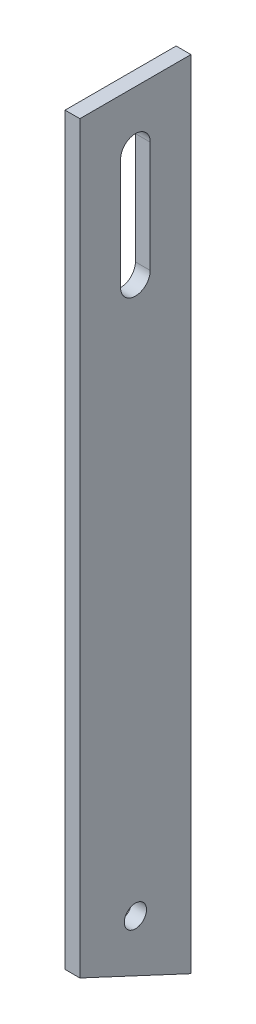
ISO-10303-21;
HEADER;
FILE_DESCRIPTION(('STEP AP214'),'2;1');
FILE_NAME('part.step','',(''),(''),'','','');
FILE_SCHEMA(('AUTOMOTIVE_DESIGN { 1 0 10303 214 1 1 1 1 }'));
ENDSEC;
DATA;
#1=APPLICATION_CONTEXT('core data for automotive mechanical design processes');
#2=APPLICATION_PROTOCOL_DEFINITION('international standard','automotive_design',2000,#1);
#3=PRODUCT_CONTEXT('',#1,'mechanical');
#4=PRODUCT('Part','Part','',(#3));
#5=PRODUCT_RELATED_PRODUCT_CATEGORY('part','',(#4));
#6=PRODUCT_DEFINITION_FORMATION('','',#4);
#7=PRODUCT_DEFINITION_CONTEXT('part definition',#1,'design');
#8=PRODUCT_DEFINITION('design','',#6,#7);
#9=PRODUCT_DEFINITION_SHAPE('','',#8);
#10=(LENGTH_UNIT() NAMED_UNIT(*) SI_UNIT(.MILLI.,.METRE.));
#11=(NAMED_UNIT(*) PLANE_ANGLE_UNIT() SI_UNIT($,.RADIAN.));
#12=(NAMED_UNIT(*) SI_UNIT($,.STERADIAN.) SOLID_ANGLE_UNIT());
#13=UNCERTAINTY_MEASURE_WITH_UNIT(LENGTH_MEASURE(1.E-05),#10,'distance_accuracy_value','');
#14=(GEOMETRIC_REPRESENTATION_CONTEXT(3) GLOBAL_UNCERTAINTY_ASSIGNED_CONTEXT((#13)) GLOBAL_UNIT_ASSIGNED_CONTEXT((#10,
#11,#12)) REPRESENTATION_CONTEXT('',''));
#15=CARTESIAN_POINT('',(0.,0.,0.));
#16=DIRECTION('',(0.,0.,1.));
#17=DIRECTION('',(1.,0.,0.));
#18=AXIS2_PLACEMENT_3D('',#15,#16,#17);
#19=CARTESIAN_POINT('',(4.,0.,0.));
#20=DIRECTION('',(1.,0.,0.));
#21=DIRECTION('',(0.,0.,-1.));
#22=AXIS2_PLACEMENT_3D('',#19,#20,#21);
#23=PLANE('',#22);
#24=CARTESIAN_POINT('',(4.0000000000001,21.,0.));
#25=DIRECTION('',(1.,0.,0.));
#26=DIRECTION('',(0.,0.,-1.));
#27=AXIS2_PLACEMENT_3D('',#24,#25,#26);
#28=CIRCLE('',#27,3.);
#29=CARTESIAN_POINT('',(4.00000000000008,21.,-3.));
#30=VERTEX_POINT('',#29);
#31=EDGE_CURVE('E336',#30,#30,#28,.T.);
#32=ORIENTED_EDGE('',*,*,#31,.F.);
#33=EDGE_LOOP('',(#32));
#34=FACE_BOUND('',#33,.T.);
#35=DIRECTION('',(0.,0.422618261740688,0.906307787036655));
#36=VECTOR('',#35,1.);
#37=CARTESIAN_POINT('',(3.99999999999989,0.,-15.));
#38=LINE('',#37,#36);
#39=CARTESIAN_POINT('',(3.99999999999989,0.,-15.));
#40=VERTEX_POINT('',#39);
#41=CARTESIAN_POINT('',(4.00000000000016,13.9892297446495,15.));
#42=VERTEX_POINT('',#41);
#43=EDGE_CURVE('E109',#40,#42,#38,.T.);
#44=ORIENTED_EDGE('',*,*,#43,.F.);
#45=DIRECTION('',(0.,1.,0.));
#46=VECTOR('',#45,1.);
#47=CARTESIAN_POINT('',(4.,215.,-15.));
#48=LINE('',#47,#46);
#49=CARTESIAN_POINT('',(4.,215.,-15.));
#50=VERTEX_POINT('',#49);
#51=EDGE_CURVE('E119',#40,#50,#48,.T.);
#52=ORIENTED_EDGE('',*,*,#51,.T.);
#53=DIRECTION('',(0.,0.,1.));
#54=VECTOR('',#53,1.);
#55=CARTESIAN_POINT('',(4.00000000000003,215.,15.));
#56=LINE('',#55,#54);
#57=CARTESIAN_POINT('',(4.00000000000003,215.,15.));
#58=VERTEX_POINT('',#57);
#59=EDGE_CURVE('E130',#50,#58,#56,.T.);
#60=ORIENTED_EDGE('',*,*,#59,.T.);
#61=DIRECTION('',(0.,-1.,0.));
#62=VECTOR('',#61,1.);
#63=CARTESIAN_POINT('',(4.00000000000003,215.,15.));
#64=LINE('',#63,#62);
#65=EDGE_CURVE('E122',#58,#42,#64,.T.);
#66=ORIENTED_EDGE('',*,*,#65,.T.);
#67=EDGE_LOOP('',(#44,#52,#60,#66));
#68=FACE_BOUND('',#67,.T.);
#69=DIRECTION('',(0.,-1.,0.));
#70=VECTOR('',#69,1.);
#71=CARTESIAN_POINT('',(4.00000000000003,200.,4.00000000000002));
#72=LINE('',#71,#70);
#73=CARTESIAN_POINT('',(4.00000000000003,200.,4.00000000000002));
#74=VERTEX_POINT('',#73);
#75=CARTESIAN_POINT('',(4.00000000000005,170.,4.00000000000002));
#76=VERTEX_POINT('',#75);
#77=EDGE_CURVE('E175',#74,#76,#72,.T.);
#78=ORIENTED_EDGE('',*,*,#77,.F.);
#79=CARTESIAN_POINT('',(4.00000000000003,200.,0.));
#80=DIRECTION('',(1.,0.,0.));
#81=DIRECTION('',(0.,0.,-1.));
#82=AXIS2_PLACEMENT_3D('',#79,#80,#81);
#83=CIRCLE('',#82,4.);
#84=CARTESIAN_POINT('',(4.,200.,-4.));
#85=VERTEX_POINT('',#84);
#86=EDGE_CURVE('E172',#85,#74,#83,.T.);
#87=ORIENTED_EDGE('',*,*,#86,.F.);
#88=DIRECTION('',(0.,1.,0.));
#89=VECTOR('',#88,1.);
#90=CARTESIAN_POINT('',(4.,200.,-4.));
#91=LINE('',#90,#89);
#92=CARTESIAN_POINT('',(4.00000000000005,170.,-4.));
#93=VERTEX_POINT('',#92);
#94=EDGE_CURVE('E182',#93,#85,#91,.T.);
#95=ORIENTED_EDGE('',*,*,#94,.F.);
#96=CARTESIAN_POINT('',(4.00000000000005,170.,0.));
#97=DIRECTION('',(1.,0.,0.));
#98=DIRECTION('',(0.,0.,-1.));
#99=AXIS2_PLACEMENT_3D('',#96,#97,#98);
#100=CIRCLE('',#99,4.);
#101=EDGE_CURVE('E179',#76,#93,#100,.T.);
#102=ORIENTED_EDGE('',*,*,#101,.F.);
#103=EDGE_LOOP('',(#78,#87,#95,#102));
#104=FACE_BOUND('',#103,.T.);
#105=ADVANCED_FACE('F40',(#34,#68,#104),#23,.T.);
#106=CARTESIAN_POINT('',(0.,0.,0.));
#107=DIRECTION('',(1.,0.,0.));
#108=DIRECTION('',(0.,0.,-1.));
#109=AXIS2_PLACEMENT_3D('',#106,#107,#108);
#110=PLANE('',#109);
#111=CARTESIAN_POINT('',(0.,21.,0.));
#112=DIRECTION('',(1.,0.,0.));
#113=DIRECTION('',(0.,0.,-1.));
#114=AXIS2_PLACEMENT_3D('',#111,#112,#113);
#115=CIRCLE('',#114,3.);
#116=CARTESIAN_POINT('',(0.,21.,-2.99999999999996));
#117=VERTEX_POINT('',#116);
#118=EDGE_CURVE('E44',#117,#117,#115,.T.);
#119=ORIENTED_EDGE('',*,*,#118,.T.);
#120=EDGE_LOOP('',(#119));
#121=FACE_BOUND('',#120,.T.);
#122=DIRECTION('',(0.,1.,0.));
#123=VECTOR('',#122,1.);
#124=CARTESIAN_POINT('',(0.,215.,-15.));
#125=LINE('',#124,#123);
#126=CARTESIAN_POINT('',(0.,0.,-15.));
#127=VERTEX_POINT('',#126);
#128=CARTESIAN_POINT('',(0.,215.,-15.));
#129=VERTEX_POINT('',#128);
#130=EDGE_CURVE('E145',#127,#129,#125,.T.);
#131=ORIENTED_EDGE('',*,*,#130,.F.);
#132=DIRECTION('',(0.,0.422618261740688,0.906307787036655));
#133=VECTOR('',#132,1.);
#134=CARTESIAN_POINT('',(0.,5.74533332339222,-2.6790929273508));
#135=LINE('',#134,#133);
#136=CARTESIAN_POINT('',(0.,13.9892297446495,15.));
#137=VERTEX_POINT('',#136);
#138=EDGE_CURVE('E112',#127,#137,#135,.T.);
#139=ORIENTED_EDGE('',*,*,#138,.T.);
#140=DIRECTION('',(0.,-1.,0.));
#141=VECTOR('',#140,1.);
#142=CARTESIAN_POINT('',(0.,215.,15.));
#143=LINE('',#142,#141);
#144=CARTESIAN_POINT('',(0.,215.,15.));
#145=VERTEX_POINT('',#144);
#146=EDGE_CURVE('E141',#145,#137,#143,.T.);
#147=ORIENTED_EDGE('',*,*,#146,.F.);
#148=DIRECTION('',(0.,0.,1.));
#149=VECTOR('',#148,1.);
#150=CARTESIAN_POINT('',(0.,215.,15.));
#151=LINE('',#150,#149);
#152=EDGE_CURVE('E137',#129,#145,#151,.T.);
#153=ORIENTED_EDGE('',*,*,#152,.F.);
#154=EDGE_LOOP('',(#131,#139,#147,#153));
#155=FACE_BOUND('',#154,.T.);
#156=CARTESIAN_POINT('',(0.,200.,0.));
#157=DIRECTION('',(1.,0.,0.));
#158=DIRECTION('',(0.,0.,-1.));
#159=AXIS2_PLACEMENT_3D('',#156,#157,#158);
#160=CIRCLE('',#159,4.);
#161=CARTESIAN_POINT('',(0.,200.,-4.));
#162=VERTEX_POINT('',#161);
#163=CARTESIAN_POINT('',(0.,200.,4.00000000000002));
#164=VERTEX_POINT('',#163);
#165=EDGE_CURVE('E65',#162,#164,#160,.T.);
#166=ORIENTED_EDGE('',*,*,#165,.T.);
#167=DIRECTION('',(0.,-1.,0.));
#168=VECTOR('',#167,1.);
#169=CARTESIAN_POINT('',(0.,200.,4.00000000000002));
#170=LINE('',#169,#168);
#171=CARTESIAN_POINT('',(0.,170.,4.00000000000002));
#172=VERTEX_POINT('',#171);
#173=EDGE_CURVE('E188',#164,#172,#170,.T.);
#174=ORIENTED_EDGE('',*,*,#173,.T.);
#175=CARTESIAN_POINT('',(0.,170.,0.));
#176=DIRECTION('',(1.,0.,0.));
#177=DIRECTION('',(0.,0.,-1.));
#178=AXIS2_PLACEMENT_3D('',#175,#176,#177);
#179=CIRCLE('',#178,4.);
#180=CARTESIAN_POINT('',(0.,170.,-4.));
#181=VERTEX_POINT('',#180);
#182=EDGE_CURVE('E192',#172,#181,#179,.T.);
#183=ORIENTED_EDGE('',*,*,#182,.T.);
#184=DIRECTION('',(0.,1.,0.));
#185=VECTOR('',#184,1.);
#186=CARTESIAN_POINT('',(0.,200.,-4.));
#187=LINE('',#186,#185);
#188=EDGE_CURVE('E176',#181,#162,#187,.T.);
#189=ORIENTED_EDGE('',*,*,#188,.T.);
#190=EDGE_LOOP('',(#166,#174,#183,#189));
#191=FACE_BOUND('',#190,.T.);
#192=ADVANCED_FACE('F163',(#121,#155,#191),#110,.F.);
#193=CARTESIAN_POINT('',(4.00000000000003,215.,15.));
#194=DIRECTION('',(0.,0.,-1.));
#195=DIRECTION('',(0.,1.,0.));
#196=AXIS2_PLACEMENT_3D('',#193,#194,#195);
#197=PLANE('',#196);
#198=ORIENTED_EDGE('',*,*,#146,.T.);
#199=DIRECTION('',(1.,0.,0.));
#200=VECTOR('',#199,1.);
#201=CARTESIAN_POINT('',(-0.99999999999989,13.9892297446495,15.));
#202=LINE('',#201,#200);
#203=EDGE_CURVE('E124',#137,#42,#202,.T.);
#204=ORIENTED_EDGE('',*,*,#203,.T.);
#205=ORIENTED_EDGE('',*,*,#65,.F.);
#206=DIRECTION('',(-1.,0.,0.));
#207=VECTOR('',#206,1.);
#208=CARTESIAN_POINT('',(4.00000000000003,215.,15.));
#209=LINE('',#208,#207);
#210=EDGE_CURVE('E134',#58,#145,#209,.T.);
#211=ORIENTED_EDGE('',*,*,#210,.T.);
#212=EDGE_LOOP('',(#198,#204,#205,#211));
#213=FACE_BOUND('',#212,.T.);
#214=ADVANCED_FACE('F42',(#213),#197,.F.);
#215=CARTESIAN_POINT('',(4.,215.,-15.));
#216=DIRECTION('',(0.,0.,1.));
#217=DIRECTION('',(0.,-1.,0.));
#218=AXIS2_PLACEMENT_3D('',#215,#216,#217);
#219=PLANE('',#218);
#220=ORIENTED_EDGE('',*,*,#130,.T.);
#221=DIRECTION('',(-1.,0.,0.));
#222=VECTOR('',#221,1.);
#223=CARTESIAN_POINT('',(4.,215.,-15.));
#224=LINE('',#223,#222);
#225=EDGE_CURVE('E50',#50,#129,#224,.T.);
#226=ORIENTED_EDGE('',*,*,#225,.F.);
#227=ORIENTED_EDGE('',*,*,#51,.F.);
#228=DIRECTION('',(-1.,0.,0.));
#229=VECTOR('',#228,1.);
#230=CARTESIAN_POINT('',(3.99999999999998,0.,-15.));
#231=LINE('',#230,#229);
#232=EDGE_CURVE('E11',#40,#127,#231,.T.);
#233=ORIENTED_EDGE('',*,*,#232,.T.);
#234=EDGE_LOOP('',(#220,#226,#227,#233));
#235=FACE_BOUND('',#234,.T.);
#236=ADVANCED_FACE('F126',(#235),#219,.F.);
#237=CARTESIAN_POINT('',(4.00000000000003,215.,15.));
#238=DIRECTION('',(0.,-1.,0.));
#239=DIRECTION('',(0.,0.,-1.));
#240=AXIS2_PLACEMENT_3D('',#237,#238,#239);
#241=PLANE('',#240);
#242=ORIENTED_EDGE('',*,*,#152,.T.);
#243=ORIENTED_EDGE('',*,*,#210,.F.);
#244=ORIENTED_EDGE('',*,*,#59,.F.);
#245=ORIENTED_EDGE('',*,*,#225,.T.);
#246=EDGE_LOOP('',(#242,#243,#244,#245));
#247=FACE_BOUND('',#246,.T.);
#248=ADVANCED_FACE('F159',(#247),#241,.F.);
#249=CARTESIAN_POINT('',(4.00000000000003,200.,0.));
#250=DIRECTION('',(-1.,0.,0.));
#251=DIRECTION('',(0.,0.,1.));
#252=AXIS2_PLACEMENT_3D('',#249,#250,#251);
#253=CYLINDRICAL_SURFACE('',#252,4.);
#254=ORIENTED_EDGE('',*,*,#165,.F.);
#255=DIRECTION('',(-1.,0.,0.));
#256=VECTOR('',#255,1.);
#257=CARTESIAN_POINT('',(4.,200.,-4.));
#258=LINE('',#257,#256);
#259=EDGE_CURVE('E185',#85,#162,#258,.T.);
#260=ORIENTED_EDGE('',*,*,#259,.F.);
#261=ORIENTED_EDGE('',*,*,#86,.T.);
#262=DIRECTION('',(-1.,0.,0.));
#263=VECTOR('',#262,1.);
#264=CARTESIAN_POINT('',(4.00000000000003,200.,4.00000000000002));
#265=LINE('',#264,#263);
#266=EDGE_CURVE('E146',#74,#164,#265,.T.);
#267=ORIENTED_EDGE('',*,*,#266,.T.);
#268=EDGE_LOOP('',(#254,#260,#261,#267));
#269=FACE_BOUND('',#268,.T.);
#270=ADVANCED_FACE('F209',(#269),#253,.F.);
#271=CARTESIAN_POINT('',(4.00000000000003,200.,4.00000000000002));
#272=DIRECTION('',(0.,0.,-1.));
#273=DIRECTION('',(0.,1.,0.));
#274=AXIS2_PLACEMENT_3D('',#271,#272,#273);
#275=PLANE('',#274);
#276=ORIENTED_EDGE('',*,*,#173,.F.);
#277=ORIENTED_EDGE('',*,*,#266,.F.);
#278=ORIENTED_EDGE('',*,*,#77,.T.);
#279=DIRECTION('',(-1.,0.,0.));
#280=VECTOR('',#279,1.);
#281=CARTESIAN_POINT('',(4.00000000000005,170.,4.00000000000002));
#282=LINE('',#281,#280);
#283=EDGE_CURVE('E203',#76,#172,#282,.T.);
#284=ORIENTED_EDGE('',*,*,#283,.T.);
#285=EDGE_LOOP('',(#276,#277,#278,#284));
#286=FACE_BOUND('',#285,.T.);
#287=ADVANCED_FACE('F218',(#286),#275,.T.);
#288=CARTESIAN_POINT('',(4.00000000000005,170.,0.));
#289=DIRECTION('',(-1.,0.,0.));
#290=DIRECTION('',(0.,0.,1.));
#291=AXIS2_PLACEMENT_3D('',#288,#289,#290);
#292=CYLINDRICAL_SURFACE('',#291,4.);
#293=ORIENTED_EDGE('',*,*,#182,.F.);
#294=ORIENTED_EDGE('',*,*,#283,.F.);
#295=ORIENTED_EDGE('',*,*,#101,.T.);
#296=DIRECTION('',(-1.,0.,0.));
#297=VECTOR('',#296,1.);
#298=CARTESIAN_POINT('',(4.00000000000005,170.,-4.));
#299=LINE('',#298,#297);
#300=EDGE_CURVE('E57',#93,#181,#299,.T.);
#301=ORIENTED_EDGE('',*,*,#300,.T.);
#302=EDGE_LOOP('',(#293,#294,#295,#301));
#303=FACE_BOUND('',#302,.T.);
#304=ADVANCED_FACE('F220',(#303),#292,.F.);
#305=CARTESIAN_POINT('',(4.,200.,-4.));
#306=DIRECTION('',(0.,0.,1.));
#307=DIRECTION('',(0.,-1.,0.));
#308=AXIS2_PLACEMENT_3D('',#305,#306,#307);
#309=PLANE('',#308);
#310=ORIENTED_EDGE('',*,*,#188,.F.);
#311=ORIENTED_EDGE('',*,*,#300,.F.);
#312=ORIENTED_EDGE('',*,*,#94,.T.);
#313=ORIENTED_EDGE('',*,*,#259,.T.);
#314=EDGE_LOOP('',(#310,#311,#312,#313));
#315=FACE_BOUND('',#314,.T.);
#316=ADVANCED_FACE('F214',(#315),#309,.T.);
#317=CARTESIAN_POINT('',(-1.00000000000008,0.,-15.));
#318=DIRECTION('',(0.,0.906307787036655,-0.422618261740688));
#319=DIRECTION('',(0.,0.422618261740688,0.906307787036655));
#320=AXIS2_PLACEMENT_3D('',#317,#318,#319);
#321=PLANE('',#320);
#322=ORIENTED_EDGE('',*,*,#232,.F.);
#323=ORIENTED_EDGE('',*,*,#43,.T.);
#324=ORIENTED_EDGE('',*,*,#203,.F.);
#325=ORIENTED_EDGE('',*,*,#138,.F.);
#326=EDGE_LOOP('',(#322,#323,#324,#325));
#327=FACE_BOUND('',#326,.T.);
#328=ADVANCED_FACE('F108',(#327),#321,.F.);
#329=CARTESIAN_POINT('',(-5.99999999999998,21.,0.));
#330=DIRECTION('',(1.,0.,0.));
#331=DIRECTION('',(0.,0.,-1.));
#332=AXIS2_PLACEMENT_3D('',#329,#330,#331);
#333=CYLINDRICAL_SURFACE('',#332,3.);
#334=ORIENTED_EDGE('',*,*,#31,.T.);
#335=EDGE_LOOP('',(#334));
#336=FACE_BOUND('',#335,.T.);
#337=ORIENTED_EDGE('',*,*,#118,.F.);
#338=EDGE_LOOP('',(#337));
#339=FACE_BOUND('',#338,.T.);
#340=ADVANCED_FACE('F294',(#336,#339),#333,.F.);
#341=CLOSED_SHELL('',(#105,#192,#214,#236,#248,#270,#287,#304,#316,#328,#340));
#342=MANIFOLD_SOLID_BREP('B2',#341);
#343=ADVANCED_BREP_SHAPE_REPRESENTATION('',(#18,#342),#14);
#344=SHAPE_DEFINITION_REPRESENTATION(#9,#343);
ENDSEC;
END-ISO-10303-21;
